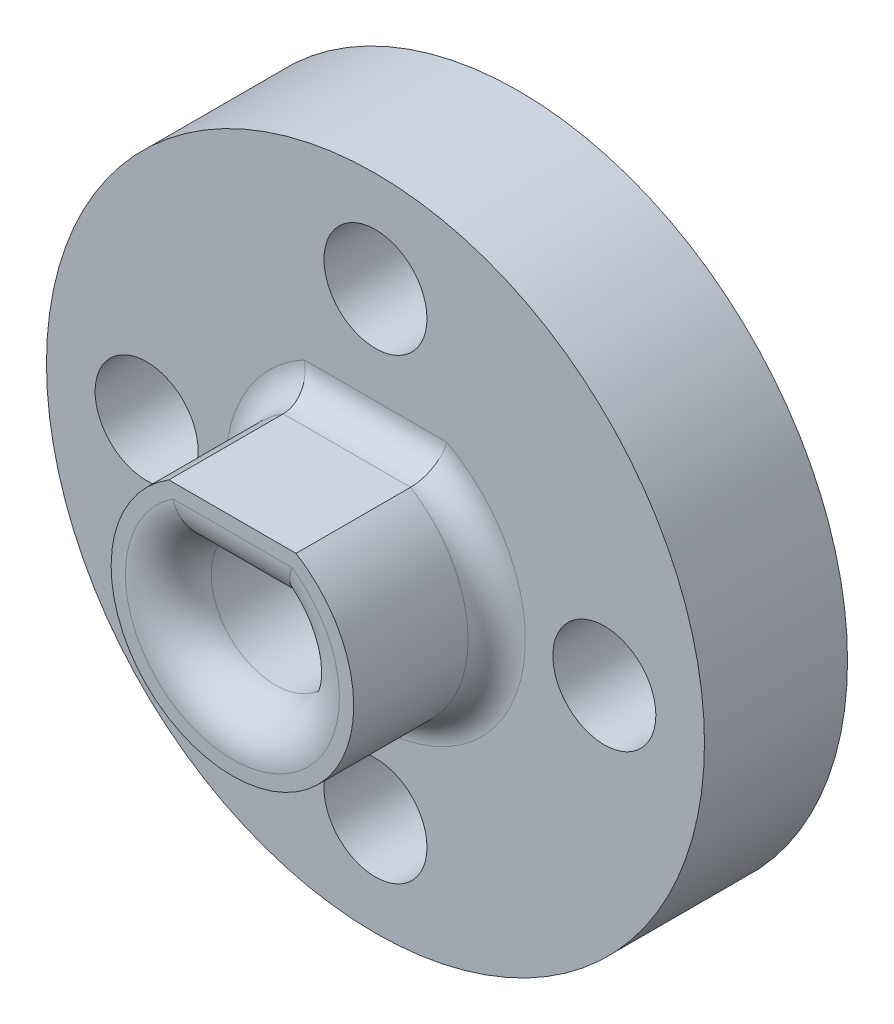
ISO-10303-21;
HEADER;
FILE_DESCRIPTION(('STEP AP214'),'2;1');
FILE_NAME('part.step','',(''),(''),'','','');
FILE_SCHEMA(('AUTOMOTIVE_DESIGN { 1 0 10303 214 1 1 1 1 }'));
ENDSEC;
DATA;
#1=APPLICATION_CONTEXT('core data for automotive mechanical design processes');
#2=APPLICATION_PROTOCOL_DEFINITION('international standard','automotive_design',2000,#1);
#3=PRODUCT_CONTEXT('',#1,'mechanical');
#4=PRODUCT('Part','Part','',(#3));
#5=PRODUCT_RELATED_PRODUCT_CATEGORY('part','',(#4));
#6=PRODUCT_DEFINITION_FORMATION('','',#4);
#7=PRODUCT_DEFINITION_CONTEXT('part definition',#1,'design');
#8=PRODUCT_DEFINITION('design','',#6,#7);
#9=PRODUCT_DEFINITION_SHAPE('','',#8);
#10=(LENGTH_UNIT() NAMED_UNIT(*) SI_UNIT(.MILLI.,.METRE.));
#11=(NAMED_UNIT(*) PLANE_ANGLE_UNIT() SI_UNIT($,.RADIAN.));
#12=(NAMED_UNIT(*) SI_UNIT($,.STERADIAN.) SOLID_ANGLE_UNIT());
#13=UNCERTAINTY_MEASURE_WITH_UNIT(LENGTH_MEASURE(1.E-05),#10,'distance_accuracy_value','');
#14=(GEOMETRIC_REPRESENTATION_CONTEXT(3) GLOBAL_UNCERTAINTY_ASSIGNED_CONTEXT((#13)) GLOBAL_UNIT_ASSIGNED_CONTEXT((#10,
#11,#12)) REPRESENTATION_CONTEXT('',''));
#15=CARTESIAN_POINT('',(0.,0.,0.));
#16=DIRECTION('',(0.,0.,1.));
#17=DIRECTION('',(1.,0.,0.));
#18=AXIS2_PLACEMENT_3D('',#15,#16,#17);
#19=CARTESIAN_POINT('',(0.,0.,5.));
#20=DIRECTION('',(0.,0.,1.));
#21=DIRECTION('',(1.,0.,0.));
#22=AXIS2_PLACEMENT_3D('',#19,#20,#21);
#23=PLANE('',#22);
#24=DIRECTION('',(1.,0.,0.));
#25=VECTOR('',#24,1.);
#26=CARTESIAN_POINT('',(2.22384801638988,4.61,5.));
#27=LINE('',#26,#25);
#28=CARTESIAN_POINT('',(-2.49108410135026,4.61,5.));
#29=VERTEX_POINT('',#28);
#30=CARTESIAN_POINT('',(2.49108410135026,4.61,5.));
#31=VERTEX_POINT('',#30);
#32=EDGE_CURVE('E201',#29,#31,#27,.T.);
#33=ORIENTED_EDGE('',*,*,#32,.T.);
#34=CARTESIAN_POINT('',(0.,0.,5.));
#35=DIRECTION('',(0.,0.,1.));
#36=DIRECTION('',(1.,0.,0.));
#37=AXIS2_PLACEMENT_3D('',#34,#35,#36);
#38=CIRCLE('',#37,5.24);
#39=EDGE_CURVE('E204',#31,#29,#38,.F.);
#40=ORIENTED_EDGE('',*,*,#39,.T.);
#41=EDGE_LOOP('',(#33,#40));
#42=FACE_BOUND('',#41,.T.);
#43=CARTESIAN_POINT('',(0.,0.,5.));
#44=DIRECTION('',(0.,0.,1.));
#45=DIRECTION('',(1.,0.,0.));
#46=AXIS2_PLACEMENT_3D('',#43,#44,#45);
#47=CIRCLE('',#46,11.5);
#48=CARTESIAN_POINT('',(11.5,0.,5.));
#49=VERTEX_POINT('',#48);
#50=EDGE_CURVE('E163',#49,#49,#47,.T.);
#51=ORIENTED_EDGE('',*,*,#50,.T.);
#52=EDGE_LOOP('',(#51));
#53=FACE_BOUND('',#52,.T.);
#54=CARTESIAN_POINT('',(-8.,0.,5.));
#55=DIRECTION('',(0.,0.,1.));
#56=DIRECTION('',(1.,0.,0.));
#57=AXIS2_PLACEMENT_3D('',#54,#55,#56);
#58=CIRCLE('',#57,1.8);
#59=CARTESIAN_POINT('',(-6.2,0.,5.));
#60=VERTEX_POINT('',#59);
#61=EDGE_CURVE('E159',#60,#60,#58,.T.);
#62=ORIENTED_EDGE('',*,*,#61,.F.);
#63=EDGE_LOOP('',(#62));
#64=FACE_BOUND('',#63,.T.);
#65=CARTESIAN_POINT('',(0.,-8.,5.));
#66=DIRECTION('',(0.,0.,1.));
#67=DIRECTION('',(1.,0.,0.));
#68=AXIS2_PLACEMENT_3D('',#65,#66,#67);
#69=CIRCLE('',#68,1.8);
#70=CARTESIAN_POINT('',(1.8,-8.,5.));
#71=VERTEX_POINT('',#70);
#72=EDGE_CURVE('E155',#71,#71,#69,.T.);
#73=ORIENTED_EDGE('',*,*,#72,.F.);
#74=EDGE_LOOP('',(#73));
#75=FACE_BOUND('',#74,.T.);
#76=CARTESIAN_POINT('',(8.,0.,5.));
#77=DIRECTION('',(0.,0.,1.));
#78=DIRECTION('',(1.,0.,0.));
#79=AXIS2_PLACEMENT_3D('',#76,#77,#78);
#80=CIRCLE('',#79,1.8);
#81=CARTESIAN_POINT('',(9.8,0.,5.));
#82=VERTEX_POINT('',#81);
#83=EDGE_CURVE('E150',#82,#82,#80,.T.);
#84=ORIENTED_EDGE('',*,*,#83,.F.);
#85=EDGE_LOOP('',(#84));
#86=FACE_BOUND('',#85,.T.);
#87=CARTESIAN_POINT('',(0.,8.,5.));
#88=DIRECTION('',(0.,0.,1.));
#89=DIRECTION('',(1.,0.,0.));
#90=AXIS2_PLACEMENT_3D('',#87,#88,#89);
#91=CIRCLE('',#90,1.8);
#92=CARTESIAN_POINT('',(1.8,8.,5.));
#93=VERTEX_POINT('',#92);
#94=EDGE_CURVE('E146',#93,#93,#91,.T.);
#95=ORIENTED_EDGE('',*,*,#94,.F.);
#96=EDGE_LOOP('',(#95));
#97=FACE_BOUND('',#96,.T.);
#98=ADVANCED_FACE('F59',(#42,#53,#64,#75,#86,#97),#23,.T.);
#99=CARTESIAN_POINT('',(0.,1.61,5.));
#100=DIRECTION('',(0.,-1.,0.));
#101=DIRECTION('',(0.,0.,-1.));
#102=AXIS2_PLACEMENT_3D('',#99,#100,#101);
#103=PLANE('',#102);
#104=DIRECTION('',(0.,0.,-1.));
#105=VECTOR('',#104,1.);
#106=CARTESIAN_POINT('',(1.55740168229009,1.61,5.));
#107=LINE('',#106,#105);
#108=CARTESIAN_POINT('',(1.55740168229009,1.61,8.5));
#109=VERTEX_POINT('',#108);
#110=CARTESIAN_POINT('',(1.55740168229009,1.61,0.));
#111=VERTEX_POINT('',#110);
#112=EDGE_CURVE('E196',#109,#111,#107,.T.);
#113=ORIENTED_EDGE('',*,*,#112,.F.);
#114=DIRECTION('',(1.,0.,0.));
#115=VECTOR('',#114,1.);
#116=CARTESIAN_POINT('',(0.,1.61,8.5));
#117=LINE('',#116,#115);
#118=CARTESIAN_POINT('',(-1.55740168229009,1.61,8.5));
#119=VERTEX_POINT('',#118);
#120=EDGE_CURVE('E74',#109,#119,#117,.F.);
#121=ORIENTED_EDGE('',*,*,#120,.T.);
#122=DIRECTION('',(0.,0.,-1.));
#123=VECTOR('',#122,1.);
#124=CARTESIAN_POINT('',(-1.55740168229009,1.61,5.));
#125=LINE('',#124,#123);
#126=CARTESIAN_POINT('',(-1.55740168229009,1.61,0.));
#127=VERTEX_POINT('',#126);
#128=EDGE_CURVE('E167',#119,#127,#125,.T.);
#129=ORIENTED_EDGE('',*,*,#128,.T.);
#130=DIRECTION('',(-1.,0.,0.));
#131=VECTOR('',#130,1.);
#132=CARTESIAN_POINT('',(0.,1.61,0.));
#133=LINE('',#132,#131);
#134=EDGE_CURVE('E187',#111,#127,#133,.T.);
#135=ORIENTED_EDGE('',*,*,#134,.F.);
#136=EDGE_LOOP('',(#113,#121,#129,#135));
#137=FACE_BOUND('',#136,.T.);
#138=ADVANCED_FACE('F258',(#137),#103,.T.);
#139=CARTESIAN_POINT('',(0.,0.,5.));
#140=DIRECTION('',(0.,0.,-1.));
#141=DIRECTION('',(-1.,0.,0.));
#142=AXIS2_PLACEMENT_3D('',#139,#140,#141);
#143=CYLINDRICAL_SURFACE('',#142,11.5);
#144=ORIENTED_EDGE('',*,*,#50,.F.);
#145=EDGE_LOOP('',(#144));
#146=FACE_BOUND('',#145,.T.);
#147=CARTESIAN_POINT('',(0.,0.,0.));
#148=DIRECTION('',(0.,0.,1.));
#149=DIRECTION('',(1.,0.,0.));
#150=AXIS2_PLACEMENT_3D('',#147,#148,#149);
#151=CIRCLE('',#150,11.5);
#152=CARTESIAN_POINT('',(11.5,0.,0.));
#153=VERTEX_POINT('',#152);
#154=EDGE_CURVE('E183',#153,#153,#151,.T.);
#155=ORIENTED_EDGE('',*,*,#154,.T.);
#156=EDGE_LOOP('',(#155));
#157=FACE_BOUND('',#156,.T.);
#158=ADVANCED_FACE('F283',(#146,#157),#143,.T.);
#159=CARTESIAN_POINT('',(-8.,0.,5.));
#160=DIRECTION('',(0.,0.,-1.));
#161=DIRECTION('',(-1.,0.,0.));
#162=AXIS2_PLACEMENT_3D('',#159,#160,#161);
#163=CYLINDRICAL_SURFACE('',#162,1.8);
#164=ORIENTED_EDGE('',*,*,#61,.T.);
#165=EDGE_LOOP('',(#164));
#166=FACE_BOUND('',#165,.T.);
#167=CARTESIAN_POINT('',(-8.,0.,0.));
#168=DIRECTION('',(0.,0.,1.));
#169=DIRECTION('',(1.,0.,0.));
#170=AXIS2_PLACEMENT_3D('',#167,#168,#169);
#171=CIRCLE('',#170,1.8);
#172=CARTESIAN_POINT('',(-6.2,0.,0.));
#173=VERTEX_POINT('',#172);
#174=EDGE_CURVE('E179',#173,#173,#171,.T.);
#175=ORIENTED_EDGE('',*,*,#174,.F.);
#176=EDGE_LOOP('',(#175));
#177=FACE_BOUND('',#176,.T.);
#178=ADVANCED_FACE('F382',(#166,#177),#163,.F.);
#179=CARTESIAN_POINT('',(0.,-8.,5.));
#180=DIRECTION('',(0.,0.,-1.));
#181=DIRECTION('',(-1.,0.,0.));
#182=AXIS2_PLACEMENT_3D('',#179,#180,#181);
#183=CYLINDRICAL_SURFACE('',#182,1.8);
#184=ORIENTED_EDGE('',*,*,#72,.T.);
#185=EDGE_LOOP('',(#184));
#186=FACE_BOUND('',#185,.T.);
#187=CARTESIAN_POINT('',(0.,-8.,0.));
#188=DIRECTION('',(0.,0.,1.));
#189=DIRECTION('',(1.,0.,0.));
#190=AXIS2_PLACEMENT_3D('',#187,#188,#189);
#191=CIRCLE('',#190,1.8);
#192=CARTESIAN_POINT('',(1.8,-8.,0.));
#193=VERTEX_POINT('',#192);
#194=EDGE_CURVE('E175',#193,#193,#191,.T.);
#195=ORIENTED_EDGE('',*,*,#194,.F.);
#196=EDGE_LOOP('',(#195));
#197=FACE_BOUND('',#196,.T.);
#198=ADVANCED_FACE('F373',(#186,#197),#183,.F.);
#199=CARTESIAN_POINT('',(8.,0.,5.));
#200=DIRECTION('',(0.,0.,-1.));
#201=DIRECTION('',(-1.,0.,0.));
#202=AXIS2_PLACEMENT_3D('',#199,#200,#201);
#203=CYLINDRICAL_SURFACE('',#202,1.8);
#204=ORIENTED_EDGE('',*,*,#83,.T.);
#205=EDGE_LOOP('',(#204));
#206=FACE_BOUND('',#205,.T.);
#207=CARTESIAN_POINT('',(8.,0.,0.));
#208=DIRECTION('',(0.,0.,1.));
#209=DIRECTION('',(1.,0.,0.));
#210=AXIS2_PLACEMENT_3D('',#207,#208,#209);
#211=CIRCLE('',#210,1.8);
#212=CARTESIAN_POINT('',(9.8,0.,0.));
#213=VERTEX_POINT('',#212);
#214=EDGE_CURVE('E171',#213,#213,#211,.T.);
#215=ORIENTED_EDGE('',*,*,#214,.F.);
#216=EDGE_LOOP('',(#215));
#217=FACE_BOUND('',#216,.T.);
#218=ADVANCED_FACE('F365',(#206,#217),#203,.F.);
#219=CARTESIAN_POINT('',(0.,8.,5.));
#220=DIRECTION('',(0.,0.,-1.));
#221=DIRECTION('',(-1.,0.,0.));
#222=AXIS2_PLACEMENT_3D('',#219,#220,#221);
#223=CYLINDRICAL_SURFACE('',#222,1.8);
#224=ORIENTED_EDGE('',*,*,#94,.T.);
#225=EDGE_LOOP('',(#224));
#226=FACE_BOUND('',#225,.T.);
#227=CARTESIAN_POINT('',(0.,8.,0.));
#228=DIRECTION('',(0.,0.,1.));
#229=DIRECTION('',(1.,0.,0.));
#230=AXIS2_PLACEMENT_3D('',#227,#228,#229);
#231=CIRCLE('',#230,1.8);
#232=CARTESIAN_POINT('',(1.8,8.,0.));
#233=VERTEX_POINT('',#232);
#234=EDGE_CURVE('E137',#233,#233,#231,.T.);
#235=ORIENTED_EDGE('',*,*,#234,.F.);
#236=EDGE_LOOP('',(#235));
#237=FACE_BOUND('',#236,.T.);
#238=ADVANCED_FACE('F274',(#226,#237),#223,.F.);
#239=CARTESIAN_POINT('',(0.,0.,5.));
#240=DIRECTION('',(0.,0.,-1.));
#241=DIRECTION('',(-1.,0.,0.));
#242=AXIS2_PLACEMENT_3D('',#239,#240,#241);
#243=CYLINDRICAL_SURFACE('',#242,2.24);
#244=ORIENTED_EDGE('',*,*,#128,.F.);
#245=CARTESIAN_POINT('',(0.,0.,8.5));
#246=DIRECTION('',(0.,0.,1.));
#247=DIRECTION('',(1.,0.,0.));
#248=AXIS2_PLACEMENT_3D('',#245,#246,#247);
#249=CIRCLE('',#248,2.24);
#250=EDGE_CURVE('E12',#119,#109,#249,.T.);
#251=ORIENTED_EDGE('',*,*,#250,.T.);
#252=ORIENTED_EDGE('',*,*,#112,.T.);
#253=CARTESIAN_POINT('',(0.,0.,0.));
#254=DIRECTION('',(0.,0.,1.));
#255=DIRECTION('',(1.,0.,0.));
#256=AXIS2_PLACEMENT_3D('',#253,#254,#255);
#257=CIRCLE('',#256,2.24);
#258=EDGE_CURVE('E151',#111,#127,#257,.F.);
#259=ORIENTED_EDGE('',*,*,#258,.T.);
#260=EDGE_LOOP('',(#244,#251,#252,#259));
#261=FACE_BOUND('',#260,.T.);
#262=ADVANCED_FACE('F260',(#261),#243,.F.);
#263=CARTESIAN_POINT('',(0.,0.,0.));
#264=DIRECTION('',(0.,0.,1.));
#265=DIRECTION('',(1.,0.,0.));
#266=AXIS2_PLACEMENT_3D('',#263,#264,#265);
#267=PLANE('',#266);
#268=ORIENTED_EDGE('',*,*,#234,.T.);
#269=EDGE_LOOP('',(#268));
#270=FACE_BOUND('',#269,.T.);
#271=ORIENTED_EDGE('',*,*,#214,.T.);
#272=EDGE_LOOP('',(#271));
#273=FACE_BOUND('',#272,.T.);
#274=ORIENTED_EDGE('',*,*,#194,.T.);
#275=EDGE_LOOP('',(#274));
#276=FACE_BOUND('',#275,.T.);
#277=ORIENTED_EDGE('',*,*,#174,.T.);
#278=EDGE_LOOP('',(#277));
#279=FACE_BOUND('',#278,.T.);
#280=ORIENTED_EDGE('',*,*,#154,.F.);
#281=EDGE_LOOP('',(#280));
#282=FACE_BOUND('',#281,.T.);
#283=ORIENTED_EDGE('',*,*,#134,.T.);
#284=ORIENTED_EDGE('',*,*,#258,.F.);
#285=EDGE_LOOP('',(#283,#284));
#286=FACE_BOUND('',#285,.T.);
#287=ADVANCED_FACE('F263',(#270,#273,#276,#279,#282,#286),#267,.F.);
#288=CARTESIAN_POINT('',(0.,0.,10.));
#289=DIRECTION('',(0.,0.,1.));
#290=DIRECTION('',(1.,0.,0.));
#291=AXIS2_PLACEMENT_3D('',#288,#289,#290);
#292=PLANE('',#291);
#293=CARTESIAN_POINT('',(0.,0.,10.));
#294=DIRECTION('',(0.,0.,1.));
#295=DIRECTION('',(1.,0.,0.));
#296=AXIS2_PLACEMENT_3D('',#293,#294,#295);
#297=CIRCLE('',#296,3.74);
#298=CARTESIAN_POINT('',(2.07737815527169,3.11,10.));
#299=VERTEX_POINT('',#298);
#300=CARTESIAN_POINT('',(-2.07737815527169,3.11,10.));
#301=VERTEX_POINT('',#300);
#302=EDGE_CURVE('E211',#299,#301,#297,.F.);
#303=ORIENTED_EDGE('',*,*,#302,.T.);
#304=DIRECTION('',(1.,0.,0.));
#305=VECTOR('',#304,1.);
#306=CARTESIAN_POINT('',(0.,3.11,10.));
#307=LINE('',#306,#305);
#308=EDGE_CURVE('E249',#301,#299,#307,.T.);
#309=ORIENTED_EDGE('',*,*,#308,.T.);
#310=EDGE_LOOP('',(#303,#309));
#311=FACE_BOUND('',#310,.T.);
#312=CARTESIAN_POINT('',(0.,0.,10.));
#313=DIRECTION('',(0.,0.,1.));
#314=DIRECTION('',(1.,0.,0.));
#315=AXIS2_PLACEMENT_3D('',#312,#313,#314);
#316=CIRCLE('',#315,4.24);
#317=CARTESIAN_POINT('',(-2.22384801638988,3.61,10.));
#318=VERTEX_POINT('',#317);
#319=CARTESIAN_POINT('',(2.22384801638988,3.61,10.));
#320=VERTEX_POINT('',#319);
#321=EDGE_CURVE('E119',#318,#320,#316,.T.);
#322=ORIENTED_EDGE('',*,*,#321,.T.);
#323=DIRECTION('',(1.,0.,0.));
#324=VECTOR('',#323,1.);
#325=CARTESIAN_POINT('',(0.,3.61,10.));
#326=LINE('',#325,#324);
#327=EDGE_CURVE('E123',#318,#320,#326,.T.);
#328=ORIENTED_EDGE('',*,*,#327,.F.);
#329=EDGE_LOOP('',(#322,#328));
#330=FACE_BOUND('',#329,.T.);
#331=ADVANCED_FACE('F121',(#311,#330),#292,.T.);
#332=CARTESIAN_POINT('',(0.,0.,10.));
#333=DIRECTION('',(0.,0.,-1.));
#334=DIRECTION('',(-1.,0.,0.));
#335=AXIS2_PLACEMENT_3D('',#332,#333,#334);
#336=CYLINDRICAL_SURFACE('',#335,4.24);
#337=DIRECTION('',(0.,0.,-1.));
#338=VECTOR('',#337,1.);
#339=CARTESIAN_POINT('',(-2.22384801638988,3.61,10.));
#340=LINE('',#339,#338);
#341=CARTESIAN_POINT('',(-2.22384801638988,3.61,6.));
#342=VERTEX_POINT('',#341);
#343=EDGE_CURVE('E138',#318,#342,#340,.T.);
#344=ORIENTED_EDGE('',*,*,#343,.T.);
#345=CARTESIAN_POINT('',(0.,0.,6.));
#346=DIRECTION('',(0.,0.,1.));
#347=DIRECTION('',(1.,0.,0.));
#348=AXIS2_PLACEMENT_3D('',#345,#346,#347);
#349=CIRCLE('',#348,4.24);
#350=CARTESIAN_POINT('',(2.22384801638988,3.61,6.));
#351=VERTEX_POINT('',#350);
#352=EDGE_CURVE('E134',#342,#351,#349,.T.);
#353=ORIENTED_EDGE('',*,*,#352,.T.);
#354=DIRECTION('',(0.,0.,-1.));
#355=VECTOR('',#354,1.);
#356=CARTESIAN_POINT('',(2.22384801638988,3.61,10.));
#357=LINE('',#356,#355);
#358=EDGE_CURVE('E131',#320,#351,#357,.T.);
#359=ORIENTED_EDGE('',*,*,#358,.F.);
#360=ORIENTED_EDGE('',*,*,#321,.F.);
#361=EDGE_LOOP('',(#344,#353,#359,#360));
#362=FACE_BOUND('',#361,.T.);
#363=ADVANCED_FACE('F132',(#362),#336,.T.);
#364=CARTESIAN_POINT('',(0.,3.61,10.));
#365=DIRECTION('',(0.,1.,0.));
#366=DIRECTION('',(0.,0.,1.));
#367=AXIS2_PLACEMENT_3D('',#364,#365,#366);
#368=PLANE('',#367);
#369=ORIENTED_EDGE('',*,*,#358,.T.);
#370=DIRECTION('',(1.,0.,0.));
#371=VECTOR('',#370,1.);
#372=CARTESIAN_POINT('',(-2.22384801638988,3.61,6.));
#373=LINE('',#372,#371);
#374=EDGE_CURVE('E208',#351,#342,#373,.F.);
#375=ORIENTED_EDGE('',*,*,#374,.T.);
#376=ORIENTED_EDGE('',*,*,#343,.F.);
#377=ORIENTED_EDGE('',*,*,#327,.T.);
#378=EDGE_LOOP('',(#369,#375,#376,#377));
#379=FACE_BOUND('',#378,.T.);
#380=ADVANCED_FACE('F140',(#379),#368,.T.);
#381=CARTESIAN_POINT('',(0.,4.61,6.));
#382=DIRECTION('',(-1.,0.,0.));
#383=DIRECTION('',(0.,0.,1.));
#384=AXIS2_PLACEMENT_3D('',#381,#382,#383);
#385=CYLINDRICAL_SURFACE('',#384,1.);
#386=CARTESIAN_POINT('',(2.22384801638988,3.61,6.));
#387=CARTESIAN_POINT('',(2.22384768707167,3.60999963088698,5.97261062964919));
#388=CARTESIAN_POINT('',(2.22416703051211,3.61112601375426,5.94523469390662));
#389=CARTESIAN_POINT('',(2.22543853067281,3.61561591087822,5.89068531083213));
#390=CARTESIAN_POINT('',(2.22639060362256,3.61897912898808,5.86351183717667));
#391=CARTESIAN_POINT('',(2.23017943260777,3.63237583238447,5.78269296471163));
#392=CARTESIAN_POINT('',(2.23394887600168,3.64571657173196,5.72959972452838));
#393=CARTESIAN_POINT('',(2.24381114983215,3.68076551120666,5.62651371838469));
#394=CARTESIAN_POINT('',(2.24990413099052,3.70247425414536,5.57652115380161));
#395=CARTESIAN_POINT('',(2.26416089305703,3.7535507607981,5.48093322289948));
#396=CARTESIAN_POINT('',(2.27232489504421,3.78291934220036,5.43533832674403));
#397=CARTESIAN_POINT('',(2.29056746262124,3.8489801232195,5.34895710929116));
#398=CARTESIAN_POINT('',(2.30067666520875,3.8857900711394,5.30826745991141));
#399=CARTESIAN_POINT('',(2.32235385350858,3.96532547532228,5.23359833724977));
#400=CARTESIAN_POINT('',(2.33392234834408,4.0080529966417,5.19962121652746));
#401=CARTESIAN_POINT('',(2.35856549597254,4.09982081171301,5.13809751170855));
#402=CARTESIAN_POINT('',(2.3716787864318,4.14903015774284,5.11081880495813));
#403=CARTESIAN_POINT('',(2.39864942167899,4.25114095843916,5.06493323958376));
#404=CARTESIAN_POINT('',(2.41250654259938,4.30404130366235,5.04632378794955));
#405=CARTESIAN_POINT('',(2.43683806901528,4.39775624593106,5.02192011033255));
#406=CARTESIAN_POINT('',(2.4472369509575,4.43806336361188,5.01403757510523));
#407=CARTESIAN_POINT('',(2.46805714313415,4.51928426733899,5.00328399676548));
#408=CARTESIAN_POINT('',(2.47847837716572,4.56019680403248,5.00040378151095));
#409=CARTESIAN_POINT('',(2.48958448040195,4.60407167560627,5.00001314795122));
#410=CARTESIAN_POINT('',(2.49033447913169,4.60703590772311,4.99999996498135));
#411=CARTESIAN_POINT('',(2.49108410135026,4.61,5.));
#412=B_SPLINE_CURVE_WITH_KNOTS('',3,(#386,#387,#388,#389,#390,#391,#392,#393,#394,#395,#396,
#397,#398,#399,#400,#401,#402,#403,#404,#405,#406,#407,#408,#409,#410,#411),.UNSPECIFIED.,.F.,
.F.,(4,2,2,2,2,2,2,2,2,2,2,2,4),(0.,0.0821165846163273,0.164222299534154,0.327991379152703,
0.49177108385043,0.655568279202432,0.822194996737125,0.988880009228729,1.16142143850177,
1.33391122672796,1.46074235521353,1.58734068248891,1.59651355761629),.UNSPECIFIED.);
#413=EDGE_CURVE('E212',#31,#351,#412,.F.);
#414=ORIENTED_EDGE('',*,*,#413,.F.);
#415=ORIENTED_EDGE('',*,*,#32,.F.);
#416=CARTESIAN_POINT('',(-2.22384801638988,3.61,6.));
#417=CARTESIAN_POINT('',(-2.22384768707167,3.60999963088698,5.97261062964919));
#418=CARTESIAN_POINT('',(-2.22416703051211,3.61112601375426,5.94523469390662));
#419=CARTESIAN_POINT('',(-2.22543853067281,3.61561591087822,5.89068531083213));
#420=CARTESIAN_POINT('',(-2.22639060362256,3.61897912898808,5.86351183717667));
#421=CARTESIAN_POINT('',(-2.23017943260777,3.63237583238447,5.78269296471163));
#422=CARTESIAN_POINT('',(-2.23394887600168,3.64571657173196,5.72959972452838));
#423=CARTESIAN_POINT('',(-2.24381114983215,3.68076551120666,5.62651371838469));
#424=CARTESIAN_POINT('',(-2.24990413099052,3.70247425414536,5.57652115380161));
#425=CARTESIAN_POINT('',(-2.26416089305703,3.7535507607981,5.48093322289948));
#426=CARTESIAN_POINT('',(-2.27232489504421,3.78291934220036,5.43533832674403));
#427=CARTESIAN_POINT('',(-2.29056746262124,3.8489801232195,5.34895710929116));
#428=CARTESIAN_POINT('',(-2.30067666520875,3.8857900711394,5.30826745991141));
#429=CARTESIAN_POINT('',(-2.32235385350858,3.96532547532228,5.23359833724977));
#430=CARTESIAN_POINT('',(-2.33392234834408,4.0080529966417,5.19962121652746));
#431=CARTESIAN_POINT('',(-2.35856549597254,4.09982081171301,5.13809751170855));
#432=CARTESIAN_POINT('',(-2.3716787864318,4.14903015774284,5.11081880495813));
#433=CARTESIAN_POINT('',(-2.39864942167899,4.25114095843916,5.06493323958376));
#434=CARTESIAN_POINT('',(-2.41250654259938,4.30404130366235,5.04632378794955));
#435=CARTESIAN_POINT('',(-2.43683806901528,4.39775624593106,5.02192011033255));
#436=CARTESIAN_POINT('',(-2.4472369509575,4.43806336361188,5.01403757510523));
#437=CARTESIAN_POINT('',(-2.46805714313415,4.51928426733899,5.00328399676548));
#438=CARTESIAN_POINT('',(-2.47847837716572,4.56019680403248,5.00040378151095));
#439=CARTESIAN_POINT('',(-2.48958448040195,4.60407167560627,5.00001314795122));
#440=CARTESIAN_POINT('',(-2.49033447913169,4.60703590772311,4.99999996498135));
#441=CARTESIAN_POINT('',(-2.49108410135026,4.61,5.));
#442=B_SPLINE_CURVE_WITH_KNOTS('',3,(#416,#417,#418,#419,#420,#421,#422,#423,#424,#425,#426,
#427,#428,#429,#430,#431,#432,#433,#434,#435,#436,#437,#438,#439,#440,#441),.UNSPECIFIED.,.F.,
.F.,(4,2,2,2,2,2,2,2,2,2,2,2,4),(0.,0.0821165846163273,0.164222299534154,0.327991379152703,
0.49177108385043,0.655568279202432,0.822194996737125,0.988880009228729,1.16142143850177,
1.33391122672796,1.46074235521353,1.58734068248891,1.59651355761629),.UNSPECIFIED.);
#443=EDGE_CURVE('E127',#342,#29,#442,.T.);
#444=ORIENTED_EDGE('',*,*,#443,.F.);
#445=ORIENTED_EDGE('',*,*,#374,.F.);
#446=EDGE_LOOP('',(#414,#415,#444,#445));
#447=FACE_BOUND('',#446,.T.);
#448=ADVANCED_FACE('F226',(#447),#385,.F.);
#449=CARTESIAN_POINT('',(0.,0.,6.));
#450=DIRECTION('',(0.,0.,1.));
#451=DIRECTION('',(1.,0.,0.));
#452=AXIS2_PLACEMENT_3D('',#449,#450,#451);
#453=TOROIDAL_SURFACE('',#452,5.24,1.);
#454=ORIENTED_EDGE('',*,*,#443,.T.);
#455=ORIENTED_EDGE('',*,*,#39,.F.);
#456=ORIENTED_EDGE('',*,*,#413,.T.);
#457=ORIENTED_EDGE('',*,*,#352,.F.);
#458=EDGE_LOOP('',(#454,#455,#456,#457));
#459=FACE_BOUND('',#458,.T.);
#460=ADVANCED_FACE('F229',(#459),#453,.F.);
#461=CARTESIAN_POINT('',(0.,0.,8.5));
#462=DIRECTION('',(0.,0.,1.));
#463=DIRECTION('',(1.,0.,0.));
#464=AXIS2_PLACEMENT_3D('',#461,#462,#463);
#465=TOROIDAL_SURFACE('',#464,3.74,1.5);
#466=CARTESIAN_POINT('',(1.55740168229009,1.61,8.5));
#467=CARTESIAN_POINT('',(1.55739978541746,1.60999868200007,8.5401873054757));
#468=CARTESIAN_POINT('',(1.55805555912311,1.61161612523762,8.58035423480376));
#469=CARTESIAN_POINT('',(1.56065879387553,1.61805816672366,8.66037831306978));
#470=CARTESIAN_POINT('',(1.56260594173301,1.62288198734914,8.70023553474866));
#471=CARTESIAN_POINT('',(1.57032962284015,1.642069372326,8.818664298669));
#472=CARTESIAN_POINT('',(1.57798877758655,1.66114940419803,8.89640581412895));
#473=CARTESIAN_POINT('',(1.59781994472132,1.71113672234076,9.04727087060019));
#474=CARTESIAN_POINT('',(1.60998990622606,1.74203863387987,9.12039649261855));
#475=CARTESIAN_POINT('',(1.63813210404688,1.81458699399847,9.26034133742132));
#476=CARTESIAN_POINT('',(1.65410623592543,1.85623879996243,9.32715739298729));
#477=CARTESIAN_POINT('',(1.6896838486744,1.95063890629181,9.45521424351694));
#478=CARTESIAN_POINT('',(1.70939631090436,2.00372952421277,9.51617179000502));
#479=CARTESIAN_POINT('',(1.75118295690847,2.11849621708465,9.62843613728952));
#480=CARTESIAN_POINT('',(1.77325793251667,2.18017517265245,9.6797396864031));
#481=CARTESIAN_POINT('',(1.8204233429359,2.31464350626361,9.7745983151284));
#482=CARTESIAN_POINT('',(1.84561623667421,2.38788952317101,9.81745522855005));
#483=CARTESIAN_POINT('',(1.89692297078578,2.54028496812854,9.89016122419263));
#484=CARTESIAN_POINT('',(1.92303680513462,2.61943435756492,9.92001039148801));
#485=CARTESIAN_POINT('',(1.97021897609007,2.76541271110356,9.96144666759363));
#486=CARTESIAN_POINT('',(1.99126061113087,2.83157116781739,9.97548181295025));
#487=CARTESIAN_POINT('',(2.03308591902283,2.96516097074856,9.99450882146173));
#488=CARTESIAN_POINT('',(2.05387003155133,3.03258943596158,9.99951912682083));
#489=CARTESIAN_POINT('',(2.0753666744188,3.1033696818872,9.99998903820129));
#490=CARTESIAN_POINT('',(2.07637278122378,3.10668483608228,10.0000000311216));
#491=CARTESIAN_POINT('',(2.07737815527169,3.11,10.));
#492=B_SPLINE_CURVE_WITH_KNOTS('',3,(#466,#467,#468,#469,#470,#471,#472,#473,#474,#475,#476,
#477,#478,#479,#480,#481,#482,#483,#484,#485,#486,#487,#488,#489,#490,#491),.UNSPECIFIED.,.F.,
.F.,(4,2,2,2,2,2,2,2,2,2,2,2,4),(0.,0.120484164908039,0.240939120188326,0.480922909926443,
0.720797722196383,0.960792311594388,1.20933278015428,1.45795681345778,1.7223557402588,
1.98675293778759,2.19870263743623,2.41021872570106,2.42061208258323),.UNSPECIFIED.);
#493=EDGE_CURVE('E239',#109,#299,#492,.T.);
#494=ORIENTED_EDGE('',*,*,#493,.F.);
#495=ORIENTED_EDGE('',*,*,#250,.F.);
#496=CARTESIAN_POINT('',(-1.55740168229009,1.61,8.5));
#497=CARTESIAN_POINT('',(-1.55739978541746,1.60999868200007,8.5401873054757));
#498=CARTESIAN_POINT('',(-1.55805555912311,1.61161612523762,8.58035423480376));
#499=CARTESIAN_POINT('',(-1.56065879387553,1.61805816672366,8.66037831306978));
#500=CARTESIAN_POINT('',(-1.56260594173301,1.62288198734914,8.70023553474866));
#501=CARTESIAN_POINT('',(-1.57032962284015,1.642069372326,8.818664298669));
#502=CARTESIAN_POINT('',(-1.57798877758655,1.66114940419803,8.89640581412895));
#503=CARTESIAN_POINT('',(-1.59781994472132,1.71113672234076,9.04727087060019));
#504=CARTESIAN_POINT('',(-1.60998990622606,1.74203863387987,9.12039649261855));
#505=CARTESIAN_POINT('',(-1.63813210404688,1.81458699399847,9.26034133742132));
#506=CARTESIAN_POINT('',(-1.65410623592543,1.85623879996243,9.32715739298729));
#507=CARTESIAN_POINT('',(-1.6896838486744,1.95063890629181,9.45521424351694));
#508=CARTESIAN_POINT('',(-1.70939631090436,2.00372952421277,9.51617179000502));
#509=CARTESIAN_POINT('',(-1.75118295690847,2.11849621708465,9.62843613728952));
#510=CARTESIAN_POINT('',(-1.77325793251667,2.18017517265245,9.6797396864031));
#511=CARTESIAN_POINT('',(-1.8204233429359,2.31464350626361,9.7745983151284));
#512=CARTESIAN_POINT('',(-1.84561623667421,2.38788952317101,9.81745522855005));
#513=CARTESIAN_POINT('',(-1.89692297078578,2.54028496812854,9.89016122419263));
#514=CARTESIAN_POINT('',(-1.92303680513462,2.61943435756492,9.92001039148801));
#515=CARTESIAN_POINT('',(-1.97021897609007,2.76541271110356,9.96144666759363));
#516=CARTESIAN_POINT('',(-1.99126061113087,2.83157116781739,9.97548181295025));
#517=CARTESIAN_POINT('',(-2.03308591902283,2.96516097074856,9.99450882146173));
#518=CARTESIAN_POINT('',(-2.05387003155133,3.03258943596158,9.99951912682083));
#519=CARTESIAN_POINT('',(-2.0753666744188,3.1033696818872,9.99998903820129));
#520=CARTESIAN_POINT('',(-2.07637278122378,3.10668483608228,10.0000000311216));
#521=CARTESIAN_POINT('',(-2.07737815527169,3.11,10.));
#522=B_SPLINE_CURVE_WITH_KNOTS('',3,(#496,#497,#498,#499,#500,#501,#502,#503,#504,#505,#506,
#507,#508,#509,#510,#511,#512,#513,#514,#515,#516,#517,#518,#519,#520,#521),.UNSPECIFIED.,.F.,
.F.,(4,2,2,2,2,2,2,2,2,2,2,2,4),(0.,0.120484164908039,0.240939120188326,0.480922909926443,
0.720797722196383,0.960792311594388,1.20933278015428,1.45795681345778,1.7223557402588,
1.98675293778759,2.19870263743623,2.41021872570106,2.42061208258323),.UNSPECIFIED.);
#523=EDGE_CURVE('E64',#301,#119,#522,.F.);
#524=ORIENTED_EDGE('',*,*,#523,.F.);
#525=ORIENTED_EDGE('',*,*,#302,.F.);
#526=EDGE_LOOP('',(#494,#495,#524,#525));
#527=FACE_BOUND('',#526,.T.);
#528=ADVANCED_FACE('F232',(#527),#465,.T.);
#529=CARTESIAN_POINT('',(0.,3.11,8.5));
#530=DIRECTION('',(1.,0.,0.));
#531=DIRECTION('',(0.,0.,-1.));
#532=AXIS2_PLACEMENT_3D('',#529,#530,#531);
#533=CYLINDRICAL_SURFACE('',#532,1.5);
#534=ORIENTED_EDGE('',*,*,#523,.T.);
#535=ORIENTED_EDGE('',*,*,#120,.F.);
#536=ORIENTED_EDGE('',*,*,#493,.T.);
#537=ORIENTED_EDGE('',*,*,#308,.F.);
#538=EDGE_LOOP('',(#534,#535,#536,#537));
#539=FACE_BOUND('',#538,.T.);
#540=ADVANCED_FACE('F61',(#539),#533,.T.);
#541=CLOSED_SHELL('',(#98,#138,#158,#178,#198,#218,#238,#262,#287,#331,#363,#380,#448,#460,#528,#540));
#542=MANIFOLD_SOLID_BREP('B2',#541);
#543=ADVANCED_BREP_SHAPE_REPRESENTATION('',(#18,#542),#14);
#544=SHAPE_DEFINITION_REPRESENTATION(#9,#543);
ENDSEC;
END-ISO-10303-21;
